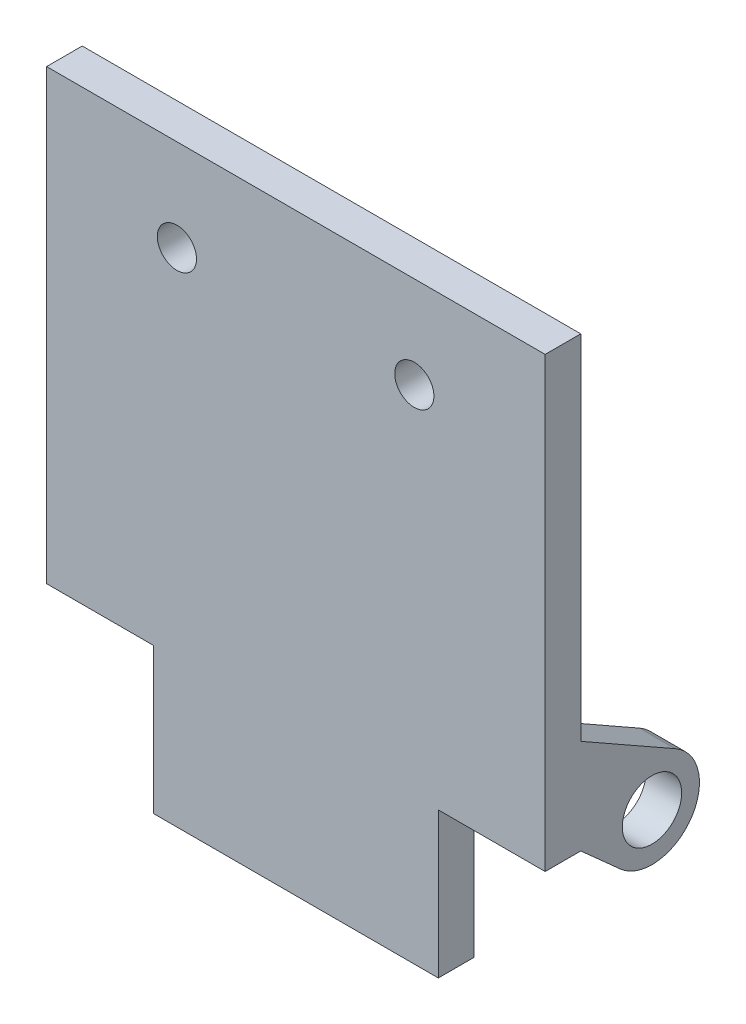
ISO-10303-21;
HEADER;
FILE_DESCRIPTION(('STEP AP214'),'2;1');
FILE_NAME('part.step','',(''),(''),'','','');
FILE_SCHEMA(('AUTOMOTIVE_DESIGN { 1 0 10303 214 1 1 1 1 }'));
ENDSEC;
DATA;
#1=APPLICATION_CONTEXT('core data for automotive mechanical design processes');
#2=APPLICATION_PROTOCOL_DEFINITION('international standard','automotive_design',2000,#1);
#3=PRODUCT_CONTEXT('',#1,'mechanical');
#4=PRODUCT('Part','Part','',(#3));
#5=PRODUCT_RELATED_PRODUCT_CATEGORY('part','',(#4));
#6=PRODUCT_DEFINITION_FORMATION('','',#4);
#7=PRODUCT_DEFINITION_CONTEXT('part definition',#1,'design');
#8=PRODUCT_DEFINITION('design','',#6,#7);
#9=PRODUCT_DEFINITION_SHAPE('','',#8);
#10=(LENGTH_UNIT() NAMED_UNIT(*) SI_UNIT(.MILLI.,.METRE.));
#11=(NAMED_UNIT(*) PLANE_ANGLE_UNIT() SI_UNIT($,.RADIAN.));
#12=(NAMED_UNIT(*) SI_UNIT($,.STERADIAN.) SOLID_ANGLE_UNIT());
#13=UNCERTAINTY_MEASURE_WITH_UNIT(LENGTH_MEASURE(1.E-05),#10,'distance_accuracy_value','');
#14=(GEOMETRIC_REPRESENTATION_CONTEXT(3) GLOBAL_UNCERTAINTY_ASSIGNED_CONTEXT((#13)) GLOBAL_UNIT_ASSIGNED_CONTEXT((#10,
#11,#12)) REPRESENTATION_CONTEXT('',''));
#15=CARTESIAN_POINT('',(0.,0.,0.));
#16=DIRECTION('',(0.,0.,1.));
#17=DIRECTION('',(1.,0.,0.));
#18=AXIS2_PLACEMENT_3D('',#15,#16,#17);
#19=CARTESIAN_POINT('',(0.,-22.,-9.));
#20=DIRECTION('',(1.,0.,0.));
#21=DIRECTION('',(0.,0.,-1.));
#22=AXIS2_PLACEMENT_3D('',#19,#20,#21);
#23=CYLINDRICAL_SURFACE('',#22,3.);
#24=DIRECTION('',(-1.,0.,0.));
#25=VECTOR('',#24,1.);
#26=CARTESIAN_POINT('',(0.,-22.,-12.));
#27=LINE('',#26,#25);
#28=CARTESIAN_POINT('',(-2.,-22.,-12.));
#29=VERTEX_POINT('',#28);
#30=CARTESIAN_POINT('',(-5.,-22.,-12.));
#31=VERTEX_POINT('',#30);
#32=EDGE_CURVE('E275',#29,#31,#27,.T.);
#33=ORIENTED_EDGE('',*,*,#32,.F.);
#34=CARTESIAN_POINT('',(-2.,-22.,-9.));
#35=DIRECTION('',(-1.,0.,0.));
#36=DIRECTION('',(0.,0.,1.));
#37=AXIS2_PLACEMENT_3D('',#34,#35,#36);
#38=CIRCLE('',#37,3.);
#39=CARTESIAN_POINT('',(-2.,-25.,-9.));
#40=VERTEX_POINT('',#39);
#41=EDGE_CURVE('E42',#40,#29,#38,.F.);
#42=ORIENTED_EDGE('',*,*,#41,.F.);
#43=DIRECTION('',(-1.,0.,0.));
#44=VECTOR('',#43,1.);
#45=CARTESIAN_POINT('',(0.,-25.,-9.));
#46=LINE('',#45,#44);
#47=CARTESIAN_POINT('',(-5.,-25.,-9.));
#48=VERTEX_POINT('',#47);
#49=EDGE_CURVE('E278',#48,#40,#46,.F.);
#50=ORIENTED_EDGE('',*,*,#49,.F.);
#51=CARTESIAN_POINT('',(-5.,-22.,-9.));
#52=DIRECTION('',(1.,0.,0.));
#53=DIRECTION('',(0.,0.,-1.));
#54=AXIS2_PLACEMENT_3D('',#51,#52,#53);
#55=CIRCLE('',#54,3.);
#56=EDGE_CURVE('E11',#31,#48,#55,.F.);
#57=ORIENTED_EDGE('',*,*,#56,.F.);
#58=EDGE_LOOP('',(#33,#42,#50,#57));
#59=FACE_BOUND('',#58,.T.);
#60=ADVANCED_FACE('F35',(#59),#23,.T.);
#61=CARTESIAN_POINT('',(3.,-25.,-5.));
#62=DIRECTION('',(0.,1.,0.));
#63=DIRECTION('',(0.,0.,1.));
#64=AXIS2_PLACEMENT_3D('',#61,#62,#63);
#65=CYLINDRICAL_SURFACE('',#64,5.);
#66=DIRECTION('',(0.,-1.,0.));
#67=VECTOR('',#66,1.);
#68=CARTESIAN_POINT('',(-2.,-25.,-5.));
#69=LINE('',#68,#67);
#70=CARTESIAN_POINT('',(-2.00000000000001,-22.3213273555428,-5.));
#71=VERTEX_POINT('',#70);
#72=CARTESIAN_POINT('',(-2.,-25.,-5.));
#73=VERTEX_POINT('',#72);
#74=EDGE_CURVE('E256',#71,#73,#69,.T.);
#75=ORIENTED_EDGE('',*,*,#74,.F.);
#76=CARTESIAN_POINT('',(-2.,-22.3213273555428,-5.));
#77=CARTESIAN_POINT('',(-1.99999865585259,-22.2943329322178,-4.99084010306282));
#78=CARTESIAN_POINT('',(-1.99997491273948,-22.2669598406963,-4.98283974000465));
#79=CARTESIAN_POINT('',(-1.99991009282106,-22.2116319119546,-4.96920322745092));
#80=CARTESIAN_POINT('',(-1.99986901655374,-22.1836770928155,-4.96356700458812));
#81=CARTESIAN_POINT('',(-1.99976297078285,-22.100758774533,-4.95051671034814));
#82=CARTESIAN_POINT('',(-1.99971208677647,-22.0452280026263,-4.94645296537758));
#83=CARTESIAN_POINT('',(-1.99972610145055,-21.9376170385381,-4.94755422390843));
#84=CARTESIAN_POINT('',(-1.9997842605876,-21.8855290151298,-4.95218206351612));
#85=CARTESIAN_POINT('',(-1.99991037932591,-21.7813705812722,-4.9696876815776));
#86=CARTESIAN_POINT('',(-1.99997855354375,-21.7293354875285,-4.98277579106642));
#87=CARTESIAN_POINT('',(-2.,-21.6786726444572,-5.));
#88=B_SPLINE_CURVE_WITH_KNOTS('',3,(#76,#77,#78,#79,#80,#81,#82,#83,#84,#85,#86,#87),
.UNSPECIFIED.,.F.,.F.,(4,2,2,2,2,4),(0.,0.0854646806368067,0.170926708820562,0.337122472356156,
0.493383210814905,0.653686460042212),.UNSPECIFIED.);
#89=CARTESIAN_POINT('',(-2.00000000000001,-21.6786726444572,-5.));
#90=VERTEX_POINT('',#89);
#91=EDGE_CURVE('E424',#71,#90,#88,.T.);
#92=ORIENTED_EDGE('',*,*,#91,.T.);
#93=CARTESIAN_POINT('',(-2.,-20.,-5.));
#94=VERTEX_POINT('',#93);
#95=EDGE_CURVE('E257',#94,#90,#69,.T.);
#96=ORIENTED_EDGE('',*,*,#95,.F.);
#97=CARTESIAN_POINT('',(3.,-20.,-5.));
#98=DIRECTION('',(0.,-1.,0.));
#99=DIRECTION('',(0.,0.,-1.));
#100=AXIS2_PLACEMENT_3D('',#97,#98,#99);
#101=CIRCLE('',#100,5.);
#102=CARTESIAN_POINT('',(3.,-20.,0.));
#103=VERTEX_POINT('',#102);
#104=EDGE_CURVE('E263',#94,#103,#101,.F.);
#105=ORIENTED_EDGE('',*,*,#104,.T.);
#106=DIRECTION('',(0.,-1.,0.));
#107=VECTOR('',#106,1.);
#108=CARTESIAN_POINT('',(3.,-25.,0.));
#109=LINE('',#108,#107);
#110=CARTESIAN_POINT('',(2.99999999999999,-25.,0.));
#111=VERTEX_POINT('',#110);
#112=EDGE_CURVE('E260',#111,#103,#109,.F.);
#113=ORIENTED_EDGE('',*,*,#112,.F.);
#114=CARTESIAN_POINT('',(3.,-25.,-5.));
#115=DIRECTION('',(0.,1.,0.));
#116=DIRECTION('',(0.,0.,1.));
#117=AXIS2_PLACEMENT_3D('',#114,#115,#116);
#118=CIRCLE('',#117,5.);
#119=EDGE_CURVE('E266',#111,#73,#118,.F.);
#120=ORIENTED_EDGE('',*,*,#119,.T.);
#121=EDGE_LOOP('',(#75,#92,#96,#105,#113,#120));
#122=FACE_BOUND('',#121,.T.);
#123=ADVANCED_FACE('F433',(#122),#65,.F.);
#124=CARTESIAN_POINT('',(3.,3.,-5.));
#125=DIRECTION('',(0.,1.,0.));
#126=DIRECTION('',(0.,0.,1.));
#127=AXIS2_PLACEMENT_3D('',#124,#125,#126);
#128=CYLINDRICAL_SURFACE('',#127,5.);
#129=DIRECTION('',(0.,-1.,0.));
#130=VECTOR('',#129,1.);
#131=CARTESIAN_POINT('',(-2.,3.,-5.));
#132=LINE('',#131,#130);
#133=CARTESIAN_POINT('',(-2.00000000000001,4.67867264445724,-5.));
#134=VERTEX_POINT('',#133);
#135=CARTESIAN_POINT('',(-2.,3.,-5.));
#136=VERTEX_POINT('',#135);
#137=EDGE_CURVE('E243',#134,#136,#132,.T.);
#138=ORIENTED_EDGE('',*,*,#137,.F.);
#139=CARTESIAN_POINT('',(-2.,4.67867264445724,-5.));
#140=CARTESIAN_POINT('',(-1.99999865585259,4.70566706778223,-4.99084010306282));
#141=CARTESIAN_POINT('',(-1.99997491273948,4.7330401593037,-4.98283974000465));
#142=CARTESIAN_POINT('',(-1.99991009282106,4.78836808804543,-4.96920322745092));
#143=CARTESIAN_POINT('',(-1.99986901655374,4.81632290718446,-4.96356700458812));
#144=CARTESIAN_POINT('',(-1.99976297078285,4.89924122546695,-4.95051671034814));
#145=CARTESIAN_POINT('',(-1.99971208677647,4.95477199737372,-4.94645296537758));
#146=CARTESIAN_POINT('',(-1.99972610145055,5.06238296146194,-4.94755422390843));
#147=CARTESIAN_POINT('',(-1.9997842605876,5.11447098487021,-4.95218206351612));
#148=CARTESIAN_POINT('',(-1.99991037932591,5.21862941872778,-4.9696876815776));
#149=CARTESIAN_POINT('',(-1.99997855354375,5.27066451247151,-4.98277579106642));
#150=CARTESIAN_POINT('',(-2.,5.32132735554276,-5.));
#151=B_SPLINE_CURVE_WITH_KNOTS('',3,(#139,#140,#141,#142,#143,#144,#145,#146,#147,#148,#149,
#150),.UNSPECIFIED.,.F.,.F.,(4,2,2,2,2,4),(0.,0.0854646806368086,0.170926708820562,
0.337122472356154,0.493383210814903,0.653686460042209),.UNSPECIFIED.);
#152=CARTESIAN_POINT('',(-2.00000000000001,5.32132735554276,-5.));
#153=VERTEX_POINT('',#152);
#154=EDGE_CURVE('E396',#134,#153,#151,.T.);
#155=ORIENTED_EDGE('',*,*,#154,.T.);
#156=CARTESIAN_POINT('',(-2.,13.,-5.));
#157=VERTEX_POINT('',#156);
#158=EDGE_CURVE('E244',#157,#153,#132,.T.);
#159=ORIENTED_EDGE('',*,*,#158,.F.);
#160=CARTESIAN_POINT('',(3.,13.,-5.));
#161=DIRECTION('',(0.,-1.,0.));
#162=DIRECTION('',(0.,0.,-1.));
#163=AXIS2_PLACEMENT_3D('',#160,#161,#162);
#164=CIRCLE('',#163,5.);
#165=CARTESIAN_POINT('',(3.,13.,0.));
#166=VERTEX_POINT('',#165);
#167=EDGE_CURVE('E250',#157,#166,#164,.F.);
#168=ORIENTED_EDGE('',*,*,#167,.T.);
#169=DIRECTION('',(0.,-1.,0.));
#170=VECTOR('',#169,1.);
#171=CARTESIAN_POINT('',(3.,3.,0.));
#172=LINE('',#171,#170);
#173=CARTESIAN_POINT('',(3.,3.,0.));
#174=VERTEX_POINT('',#173);
#175=EDGE_CURVE('E247',#174,#166,#172,.F.);
#176=ORIENTED_EDGE('',*,*,#175,.F.);
#177=CARTESIAN_POINT('',(3.,3.,-5.));
#178=DIRECTION('',(0.,1.,0.));
#179=DIRECTION('',(-1.,0.,0.));
#180=AXIS2_PLACEMENT_3D('',#177,#178,#179);
#181=CIRCLE('',#180,5.);
#182=EDGE_CURVE('E253',#174,#136,#181,.F.);
#183=ORIENTED_EDGE('',*,*,#182,.T.);
#184=EDGE_LOOP('',(#138,#155,#159,#168,#176,#183));
#185=FACE_BOUND('',#184,.T.);
#186=ADVANCED_FACE('F406',(#185),#128,.F.);
#187=CARTESIAN_POINT('',(0.,0.,0.));
#188=DIRECTION('',(0.,0.,1.));
#189=DIRECTION('',(1.,0.,0.));
#190=AXIS2_PLACEMENT_3D('',#187,#188,#189);
#191=PLANE('',#190);
#192=CARTESIAN_POINT('',(-10.0242005084872,17.2660463593125,0.));
#193=DIRECTION('',(0.,0.,1.));
#194=DIRECTION('',(1.,0.,0.));
#195=AXIS2_PLACEMENT_3D('',#192,#193,#194);
#196=CIRCLE('',#195,1.65);
#197=CARTESIAN_POINT('',(-8.37420050848724,17.2660463593125,0.));
#198=VERTEX_POINT('',#197);
#199=EDGE_CURVE('E734',#198,#198,#196,.T.);
#200=ORIENTED_EDGE('',*,*,#199,.T.);
#201=EDGE_LOOP('',(#200));
#202=FACE_BOUND('',#201,.T.);
#203=CARTESIAN_POINT('',(9.97579949151276,17.2660463593125,0.));
#204=DIRECTION('',(0.,0.,1.));
#205=DIRECTION('',(1.,0.,0.));
#206=AXIS2_PLACEMENT_3D('',#203,#204,#205);
#207=CIRCLE('',#206,1.65);
#208=CARTESIAN_POINT('',(11.6257994915128,17.2660463593125,0.));
#209=VERTEX_POINT('',#208);
#210=EDGE_CURVE('E335',#209,#209,#207,.T.);
#211=ORIENTED_EDGE('',*,*,#210,.T.);
#212=EDGE_LOOP('',(#211));
#213=FACE_BOUND('',#212,.T.);
#214=DIRECTION('',(1.,0.,0.));
#215=VECTOR('',#214,1.);
#216=CARTESIAN_POINT('',(-21.,-25.,0.));
#217=LINE('',#216,#215);
#218=CARTESIAN_POINT('',(-12.,-25.,0.));
#219=VERTEX_POINT('',#218);
#220=CARTESIAN_POINT('',(-5.00000000000001,-25.,0.));
#221=VERTEX_POINT('',#220);
#222=EDGE_CURVE('E236',#219,#221,#217,.T.);
#223=ORIENTED_EDGE('',*,*,#222,.F.);
#224=DIRECTION('',(0.,-1.,0.));
#225=VECTOR('',#224,1.);
#226=CARTESIAN_POINT('',(-12.,-25.,0.));
#227=LINE('',#226,#225);
#228=CARTESIAN_POINT('',(-12.,-12.7339536406875,0.));
#229=VERTEX_POINT('',#228);
#230=EDGE_CURVE('E206',#229,#219,#227,.T.);
#231=ORIENTED_EDGE('',*,*,#230,.F.);
#232=DIRECTION('',(1.,0.,0.));
#233=VECTOR('',#232,1.);
#234=CARTESIAN_POINT('',(-21.,-12.7339536406875,0.));
#235=LINE('',#234,#233);
#236=CARTESIAN_POINT('',(-21.,-12.7339536406875,0.));
#237=VERTEX_POINT('',#236);
#238=EDGE_CURVE('E334',#237,#229,#235,.T.);
#239=ORIENTED_EDGE('',*,*,#238,.F.);
#240=DIRECTION('',(0.,-1.,0.));
#241=VECTOR('',#240,1.);
#242=CARTESIAN_POINT('',(-21.,25.,0.));
#243=LINE('',#242,#241);
#244=CARTESIAN_POINT('',(-21.,25.,0.));
#245=VERTEX_POINT('',#244);
#246=EDGE_CURVE('E215',#245,#237,#243,.T.);
#247=ORIENTED_EDGE('',*,*,#246,.F.);
#248=DIRECTION('',(-1.,0.,0.));
#249=VECTOR('',#248,1.);
#250=CARTESIAN_POINT('',(-21.,25.,0.));
#251=LINE('',#250,#249);
#252=CARTESIAN_POINT('',(21.,25.,0.));
#253=VERTEX_POINT('',#252);
#254=EDGE_CURVE('E231',#253,#245,#251,.T.);
#255=ORIENTED_EDGE('',*,*,#254,.F.);
#256=DIRECTION('',(0.,1.,0.));
#257=VECTOR('',#256,1.);
#258=CARTESIAN_POINT('',(21.,25.,0.));
#259=LINE('',#258,#257);
#260=CARTESIAN_POINT('',(21.,-4.73395364068748,0.));
#261=VERTEX_POINT('',#260);
#262=EDGE_CURVE('E229',#261,#253,#259,.T.);
#263=ORIENTED_EDGE('',*,*,#262,.F.);
#264=DIRECTION('',(1.,0.,0.));
#265=VECTOR('',#264,1.);
#266=CARTESIAN_POINT('',(18.,-4.73395364068748,0.));
#267=LINE('',#266,#265);
#268=CARTESIAN_POINT('',(18.,-4.73395364068748,0.));
#269=VERTEX_POINT('',#268);
#270=EDGE_CURVE('E380',#269,#261,#267,.T.);
#271=ORIENTED_EDGE('',*,*,#270,.F.);
#272=DIRECTION('',(0.,-1.,0.));
#273=VECTOR('',#272,1.);
#274=CARTESIAN_POINT('',(18.,-4.73395364068748,0.));
#275=LINE('',#274,#273);
#276=CARTESIAN_POINT('',(18.,-12.7339536406875,0.));
#277=VERTEX_POINT('',#276);
#278=EDGE_CURVE('E370',#269,#277,#275,.T.);
#279=ORIENTED_EDGE('',*,*,#278,.T.);
#280=DIRECTION('',(1.,0.,0.));
#281=VECTOR('',#280,1.);
#282=CARTESIAN_POINT('',(21.,-12.7339536406875,0.));
#283=LINE('',#282,#281);
#284=CARTESIAN_POINT('',(12.,-12.7339536406875,0.));
#285=VERTEX_POINT('',#284);
#286=EDGE_CURVE('E350',#285,#277,#283,.T.);
#287=ORIENTED_EDGE('',*,*,#286,.F.);
#288=DIRECTION('',(0.,1.,0.));
#289=VECTOR('',#288,1.);
#290=CARTESIAN_POINT('',(12.,-25.,0.));
#291=LINE('',#290,#289);
#292=CARTESIAN_POINT('',(12.,-25.,0.));
#293=VERTEX_POINT('',#292);
#294=EDGE_CURVE('E346',#293,#285,#291,.T.);
#295=ORIENTED_EDGE('',*,*,#294,.F.);
#296=EDGE_CURVE('E235',#111,#293,#217,.T.);
#297=ORIENTED_EDGE('',*,*,#296,.F.);
#298=ORIENTED_EDGE('',*,*,#112,.T.);
#299=DIRECTION('',(1.,0.,0.));
#300=VECTOR('',#299,1.);
#301=CARTESIAN_POINT('',(-5.,-20.,0.));
#302=LINE('',#301,#300);
#303=CARTESIAN_POINT('',(-5.,-20.,0.));
#304=VERTEX_POINT('',#303);
#305=EDGE_CURVE('E303',#304,#103,#302,.T.);
#306=ORIENTED_EDGE('',*,*,#305,.F.);
#307=DIRECTION('',(0.,1.,0.));
#308=VECTOR('',#307,1.);
#309=CARTESIAN_POINT('',(-5.,-25.,0.));
#310=LINE('',#309,#308);
#311=EDGE_CURVE('E300',#221,#304,#310,.T.);
#312=ORIENTED_EDGE('',*,*,#311,.F.);
#313=EDGE_LOOP('',(#223,#231,#239,#247,#255,#263,#271,#279,#287,#295,#297,#298,#306,#312));
#314=FACE_BOUND('',#313,.T.);
#315=ORIENTED_EDGE('',*,*,#175,.T.);
#316=DIRECTION('',(1.,0.,0.));
#317=VECTOR('',#316,1.);
#318=CARTESIAN_POINT('',(-5.,13.,0.));
#319=LINE('',#318,#317);
#320=CARTESIAN_POINT('',(-5.,13.,0.));
#321=VERTEX_POINT('',#320);
#322=EDGE_CURVE('E780',#321,#166,#319,.T.);
#323=ORIENTED_EDGE('',*,*,#322,.F.);
#324=DIRECTION('',(0.,1.,0.));
#325=VECTOR('',#324,1.);
#326=CARTESIAN_POINT('',(-5.,3.,0.));
#327=LINE('',#326,#325);
#328=CARTESIAN_POINT('',(-5.,3.,0.));
#329=VERTEX_POINT('',#328);
#330=EDGE_CURVE('E430',#329,#321,#327,.T.);
#331=ORIENTED_EDGE('',*,*,#330,.F.);
#332=DIRECTION('',(-1.,0.,0.));
#333=VECTOR('',#332,1.);
#334=CARTESIAN_POINT('',(-5.,3.,0.));
#335=LINE('',#334,#333);
#336=EDGE_CURVE('E765',#174,#329,#335,.T.);
#337=ORIENTED_EDGE('',*,*,#336,.F.);
#338=EDGE_LOOP('',(#315,#323,#331,#337));
#339=FACE_BOUND('',#338,.T.);
#340=ADVANCED_FACE('F331',(#202,#213,#314,#339),#191,.F.);
#341=CARTESIAN_POINT('',(21.,25.,3.));
#342=DIRECTION('',(-1.,0.,0.));
#343=DIRECTION('',(0.,-1.,0.));
#344=AXIS2_PLACEMENT_3D('',#341,#342,#343);
#345=PLANE('',#344);
#346=DIRECTION('',(0.,1.,0.));
#347=VECTOR('',#346,1.);
#348=CARTESIAN_POINT('',(21.,25.,3.));
#349=LINE('',#348,#347);
#350=CARTESIAN_POINT('',(21.,-12.7339536406875,3.));
#351=VERTEX_POINT('',#350);
#352=CARTESIAN_POINT('',(21.,25.,3.));
#353=VERTEX_POINT('',#352);
#354=EDGE_CURVE('E225',#351,#353,#349,.T.);
#355=ORIENTED_EDGE('',*,*,#354,.F.);
#356=DIRECTION('',(0.,0.,-1.));
#357=VECTOR('',#356,1.);
#358=CARTESIAN_POINT('',(21.,-12.7339536406875,3.));
#359=LINE('',#358,#357);
#360=CARTESIAN_POINT('',(21.,-12.7339536406875,0.));
#361=VERTEX_POINT('',#360);
#362=EDGE_CURVE('E356',#351,#361,#359,.T.);
#363=ORIENTED_EDGE('',*,*,#362,.T.);
#364=DIRECTION('',(0.,-0.666666666666667,-0.74535599249993));
#365=VECTOR('',#364,1.);
#366=CARTESIAN_POINT('',(21.,-12.7339536406875,0.));
#367=LINE('',#366,#365);
#368=CARTESIAN_POINT('',(21.,-15.7153776106872,-3.33333333333333));
#369=VERTEX_POINT('',#368);
#370=EDGE_CURVE('E382',#361,#369,#367,.T.);
#371=ORIENTED_EDGE('',*,*,#370,.T.);
#372=CARTESIAN_POINT('',(21.,-12.7339536406875,-6.));
#373=DIRECTION('',(1.,0.,0.));
#374=DIRECTION('',(0.,1.,0.));
#375=AXIS2_PLACEMENT_3D('',#372,#373,#374);
#376=CIRCLE('',#375,4.);
#377=CARTESIAN_POINT('',(21.,-9.25431730710868,-7.97284844477174));
#378=VERTEX_POINT('',#377);
#379=EDGE_CURVE('E371',#369,#378,#376,.T.);
#380=ORIENTED_EDGE('',*,*,#379,.T.);
#381=DIRECTION('',(0.,0.493212111192935,0.869909083394701));
#382=VECTOR('',#381,1.);
#383=CARTESIAN_POINT('',(21.,-4.73395364068748,0.));
#384=LINE('',#383,#382);
#385=EDGE_CURVE('E326',#378,#261,#384,.T.);
#386=ORIENTED_EDGE('',*,*,#385,.T.);
#387=ORIENTED_EDGE('',*,*,#262,.T.);
#388=DIRECTION('',(0.,0.,-1.));
#389=VECTOR('',#388,1.);
#390=CARTESIAN_POINT('',(21.,25.,3.));
#391=LINE('',#390,#389);
#392=EDGE_CURVE('E240',#353,#253,#391,.T.);
#393=ORIENTED_EDGE('',*,*,#392,.F.);
#394=EDGE_LOOP('',(#355,#363,#371,#380,#386,#387,#393));
#395=FACE_BOUND('',#394,.T.);
#396=CARTESIAN_POINT('',(21.,-12.7339536406875,-6.));
#397=DIRECTION('',(1.,0.,0.));
#398=DIRECTION('',(0.,1.,0.));
#399=AXIS2_PLACEMENT_3D('',#396,#397,#398);
#400=CIRCLE('',#399,2.5);
#401=CARTESIAN_POINT('',(21.,-10.2339536406875,-6.));
#402=VERTEX_POINT('',#401);
#403=EDGE_CURVE('E358',#402,#402,#400,.T.);
#404=ORIENTED_EDGE('',*,*,#403,.F.);
#405=EDGE_LOOP('',(#404));
#406=FACE_BOUND('',#405,.T.);
#407=ADVANCED_FACE('F320',(#395,#406),#345,.F.);
#408=CARTESIAN_POINT('',(-21.,25.,3.));
#409=DIRECTION('',(0.,-1.,0.));
#410=DIRECTION('',(0.,0.,-1.));
#411=AXIS2_PLACEMENT_3D('',#408,#409,#410);
#412=PLANE('',#411);
#413=ORIENTED_EDGE('',*,*,#254,.T.);
#414=DIRECTION('',(0.,0.,-1.));
#415=VECTOR('',#414,1.);
#416=CARTESIAN_POINT('',(-21.,25.,3.));
#417=LINE('',#416,#415);
#418=CARTESIAN_POINT('',(-21.,25.,3.));
#419=VERTEX_POINT('',#418);
#420=EDGE_CURVE('E223',#419,#245,#417,.T.);
#421=ORIENTED_EDGE('',*,*,#420,.F.);
#422=DIRECTION('',(-1.,0.,0.));
#423=VECTOR('',#422,1.);
#424=CARTESIAN_POINT('',(-21.,25.,3.));
#425=LINE('',#424,#423);
#426=EDGE_CURVE('E219',#353,#419,#425,.T.);
#427=ORIENTED_EDGE('',*,*,#426,.F.);
#428=ORIENTED_EDGE('',*,*,#392,.T.);
#429=EDGE_LOOP('',(#413,#421,#427,#428));
#430=FACE_BOUND('',#429,.T.);
#431=ADVANCED_FACE('F319',(#430),#412,.F.);
#432=CARTESIAN_POINT('',(-21.,25.,3.));
#433=DIRECTION('',(1.,0.,0.));
#434=DIRECTION('',(0.,1.,0.));
#435=AXIS2_PLACEMENT_3D('',#432,#433,#434);
#436=PLANE('',#435);
#437=ORIENTED_EDGE('',*,*,#246,.T.);
#438=DIRECTION('',(0.,0.,-1.));
#439=VECTOR('',#438,1.);
#440=CARTESIAN_POINT('',(-21.,-12.7339536406875,3.));
#441=LINE('',#440,#439);
#442=CARTESIAN_POINT('',(-21.,-12.7339536406875,3.));
#443=VERTEX_POINT('',#442);
#444=EDGE_CURVE('E199',#443,#237,#441,.T.);
#445=ORIENTED_EDGE('',*,*,#444,.F.);
#446=DIRECTION('',(0.,-1.,0.));
#447=VECTOR('',#446,1.);
#448=CARTESIAN_POINT('',(-21.,25.,3.));
#449=LINE('',#448,#447);
#450=EDGE_CURVE('E213',#419,#443,#449,.T.);
#451=ORIENTED_EDGE('',*,*,#450,.F.);
#452=ORIENTED_EDGE('',*,*,#420,.T.);
#453=EDGE_LOOP('',(#437,#445,#451,#452));
#454=FACE_BOUND('',#453,.T.);
#455=ADVANCED_FACE('F211',(#454),#436,.F.);
#456=CARTESIAN_POINT('',(-21.,-25.,3.));
#457=DIRECTION('',(0.,1.,0.));
#458=DIRECTION('',(0.,0.,1.));
#459=AXIS2_PLACEMENT_3D('',#456,#457,#458);
#460=PLANE('',#459);
#461=DIRECTION('',(0.,0.,1.));
#462=VECTOR('',#461,1.);
#463=CARTESIAN_POINT('',(-5.,-25.,-12.));
#464=LINE('',#463,#462);
#465=EDGE_CURVE('E293',#48,#221,#464,.T.);
#466=ORIENTED_EDGE('',*,*,#465,.F.);
#467=ORIENTED_EDGE('',*,*,#49,.T.);
#468=DIRECTION('',(0.,0.,1.));
#469=VECTOR('',#468,1.);
#470=CARTESIAN_POINT('',(-2.,-25.,-12.));
#471=LINE('',#470,#469);
#472=EDGE_CURVE('E287',#40,#73,#471,.T.);
#473=ORIENTED_EDGE('',*,*,#472,.T.);
#474=ORIENTED_EDGE('',*,*,#119,.F.);
#475=ORIENTED_EDGE('',*,*,#296,.T.);
#476=DIRECTION('',(0.,0.,-1.));
#477=VECTOR('',#476,1.);
#478=CARTESIAN_POINT('',(12.,-25.,3.));
#479=LINE('',#478,#477);
#480=CARTESIAN_POINT('',(12.,-25.,3.));
#481=VERTEX_POINT('',#480);
#482=EDGE_CURVE('E352',#481,#293,#479,.T.);
#483=ORIENTED_EDGE('',*,*,#482,.F.);
#484=DIRECTION('',(1.,0.,0.));
#485=VECTOR('',#484,1.);
#486=CARTESIAN_POINT('',(-21.,-25.,3.));
#487=LINE('',#486,#485);
#488=CARTESIAN_POINT('',(-12.,-25.,3.));
#489=VERTEX_POINT('',#488);
#490=EDGE_CURVE('E221',#489,#481,#487,.T.);
#491=ORIENTED_EDGE('',*,*,#490,.F.);
#492=DIRECTION('',(0.,0.,-1.));
#493=VECTOR('',#492,1.);
#494=CARTESIAN_POINT('',(-12.,-25.,3.));
#495=LINE('',#494,#493);
#496=EDGE_CURVE('E343',#489,#219,#495,.T.);
#497=ORIENTED_EDGE('',*,*,#496,.T.);
#498=ORIENTED_EDGE('',*,*,#222,.T.);
#499=EDGE_LOOP('',(#466,#467,#473,#474,#475,#483,#491,#497,#498));
#500=FACE_BOUND('',#499,.T.);
#501=ADVANCED_FACE('F455',(#500),#460,.F.);
#502=CARTESIAN_POINT('',(0.,0.,3.));
#503=DIRECTION('',(0.,0.,1.));
#504=DIRECTION('',(1.,0.,0.));
#505=AXIS2_PLACEMENT_3D('',#502,#503,#504);
#506=PLANE('',#505);
#507=CARTESIAN_POINT('',(-10.0242005084872,17.2660463593125,3.));
#508=DIRECTION('',(0.,0.,1.));
#509=DIRECTION('',(1.,0.,0.));
#510=AXIS2_PLACEMENT_3D('',#507,#508,#509);
#511=CIRCLE('',#510,1.65);
#512=CARTESIAN_POINT('',(-8.37420050848724,17.2660463593125,3.));
#513=VERTEX_POINT('',#512);
#514=EDGE_CURVE('E731',#513,#513,#511,.T.);
#515=ORIENTED_EDGE('',*,*,#514,.F.);
#516=EDGE_LOOP('',(#515));
#517=FACE_BOUND('',#516,.T.);
#518=CARTESIAN_POINT('',(9.97579949151276,17.2660463593125,3.));
#519=DIRECTION('',(0.,0.,1.));
#520=DIRECTION('',(1.,0.,0.));
#521=AXIS2_PLACEMENT_3D('',#518,#519,#520);
#522=CIRCLE('',#521,1.65);
#523=CARTESIAN_POINT('',(11.6257994915128,17.2660463593125,3.));
#524=VERTEX_POINT('',#523);
#525=EDGE_CURVE('E339',#524,#524,#522,.T.);
#526=ORIENTED_EDGE('',*,*,#525,.F.);
#527=EDGE_LOOP('',(#526));
#528=FACE_BOUND('',#527,.T.);
#529=DIRECTION('',(0.,-1.,0.));
#530=VECTOR('',#529,1.);
#531=CARTESIAN_POINT('',(-12.,-25.,3.));
#532=LINE('',#531,#530);
#533=CARTESIAN_POINT('',(-12.,-12.7339536406875,3.));
#534=VERTEX_POINT('',#533);
#535=EDGE_CURVE('E205',#534,#489,#532,.T.);
#536=ORIENTED_EDGE('',*,*,#535,.T.);
#537=ORIENTED_EDGE('',*,*,#490,.T.);
#538=DIRECTION('',(0.,1.,0.));
#539=VECTOR('',#538,1.);
#540=CARTESIAN_POINT('',(12.,-25.,3.));
#541=LINE('',#540,#539);
#542=CARTESIAN_POINT('',(12.,-12.7339536406875,3.));
#543=VERTEX_POINT('',#542);
#544=EDGE_CURVE('E348',#481,#543,#541,.T.);
#545=ORIENTED_EDGE('',*,*,#544,.T.);
#546=DIRECTION('',(1.,0.,0.));
#547=VECTOR('',#546,1.);
#548=CARTESIAN_POINT('',(21.,-12.7339536406875,3.));
#549=LINE('',#548,#547);
#550=EDGE_CURVE('E314',#543,#351,#549,.T.);
#551=ORIENTED_EDGE('',*,*,#550,.T.);
#552=ORIENTED_EDGE('',*,*,#354,.T.);
#553=ORIENTED_EDGE('',*,*,#426,.T.);
#554=ORIENTED_EDGE('',*,*,#450,.T.);
#555=DIRECTION('',(1.,0.,0.));
#556=VECTOR('',#555,1.);
#557=CARTESIAN_POINT('',(-21.,-12.7339536406875,3.));
#558=LINE('',#557,#556);
#559=EDGE_CURVE('E195',#443,#534,#558,.T.);
#560=ORIENTED_EDGE('',*,*,#559,.T.);
#561=EDGE_LOOP('',(#536,#537,#545,#551,#552,#553,#554,#560));
#562=FACE_BOUND('',#561,.T.);
#563=ADVANCED_FACE('F217',(#517,#528,#562),#506,.T.);
#564=CARTESIAN_POINT('',(-5.,-25.,-12.));
#565=DIRECTION('',(1.,0.,0.));
#566=DIRECTION('',(0.,0.,-1.));
#567=AXIS2_PLACEMENT_3D('',#564,#565,#566);
#568=PLANE('',#567);
#569=CARTESIAN_POINT('',(-5.,-22.,-5.94696817822982));
#570=DIRECTION('',(-1.,0.,0.));
#571=DIRECTION('',(0.,0.,1.));
#572=AXIS2_PLACEMENT_3D('',#569,#570,#571);
#573=CIRCLE('',#572,1.);
#574=CARTESIAN_POINT('',(-5.,-22.,-4.94696817822982));
#575=VERTEX_POINT('',#574);
#576=EDGE_CURVE('E404',#575,#575,#573,.T.);
#577=ORIENTED_EDGE('',*,*,#576,.F.);
#578=EDGE_LOOP('',(#577));
#579=FACE_BOUND('',#578,.T.);
#580=DIRECTION('',(0.,1.,0.));
#581=VECTOR('',#580,1.);
#582=CARTESIAN_POINT('',(-5.,-25.,-12.));
#583=LINE('',#582,#581);
#584=CARTESIAN_POINT('',(-5.,-20.,-12.));
#585=VERTEX_POINT('',#584);
#586=EDGE_CURVE('E296',#31,#585,#583,.T.);
#587=ORIENTED_EDGE('',*,*,#586,.F.);
#588=ORIENTED_EDGE('',*,*,#56,.T.);
#589=ORIENTED_EDGE('',*,*,#465,.T.);
#590=ORIENTED_EDGE('',*,*,#311,.T.);
#591=DIRECTION('',(0.,0.,1.));
#592=VECTOR('',#591,1.);
#593=CARTESIAN_POINT('',(-5.,-20.,-12.));
#594=LINE('',#593,#592);
#595=EDGE_CURVE('E232',#585,#304,#594,.T.);
#596=ORIENTED_EDGE('',*,*,#595,.F.);
#597=EDGE_LOOP('',(#587,#588,#589,#590,#596));
#598=FACE_BOUND('',#597,.T.);
#599=ADVANCED_FACE('F457',(#579,#598),#568,.F.);
#600=CARTESIAN_POINT('',(-5.,-20.,-12.));
#601=DIRECTION('',(0.,-1.,0.));
#602=DIRECTION('',(0.,0.,-1.));
#603=AXIS2_PLACEMENT_3D('',#600,#601,#602);
#604=PLANE('',#603);
#605=ORIENTED_EDGE('',*,*,#305,.T.);
#606=ORIENTED_EDGE('',*,*,#104,.F.);
#607=DIRECTION('',(0.,0.,1.));
#608=VECTOR('',#607,1.);
#609=CARTESIAN_POINT('',(-2.,-20.,-12.));
#610=LINE('',#609,#608);
#611=CARTESIAN_POINT('',(-2.,-20.,-12.));
#612=VERTEX_POINT('',#611);
#613=EDGE_CURVE('E307',#612,#94,#610,.T.);
#614=ORIENTED_EDGE('',*,*,#613,.F.);
#615=DIRECTION('',(1.,0.,0.));
#616=VECTOR('',#615,1.);
#617=CARTESIAN_POINT('',(-5.,-20.,-12.));
#618=LINE('',#617,#616);
#619=EDGE_CURVE('E291',#585,#612,#618,.T.);
#620=ORIENTED_EDGE('',*,*,#619,.F.);
#621=ORIENTED_EDGE('',*,*,#595,.T.);
#622=EDGE_LOOP('',(#605,#606,#614,#620,#621));
#623=FACE_BOUND('',#622,.T.);
#624=ADVANCED_FACE('F459',(#623),#604,.F.);
#625=CARTESIAN_POINT('',(-2.,-25.,-12.));
#626=DIRECTION('',(-1.,0.,0.));
#627=DIRECTION('',(0.,0.,1.));
#628=AXIS2_PLACEMENT_3D('',#625,#626,#627);
#629=PLANE('',#628);
#630=ORIENTED_EDGE('',*,*,#472,.F.);
#631=ORIENTED_EDGE('',*,*,#41,.T.);
#632=DIRECTION('',(0.,-1.,0.));
#633=VECTOR('',#632,1.);
#634=CARTESIAN_POINT('',(-2.,-25.,-12.));
#635=LINE('',#634,#633);
#636=EDGE_CURVE('E285',#612,#29,#635,.T.);
#637=ORIENTED_EDGE('',*,*,#636,.F.);
#638=ORIENTED_EDGE('',*,*,#613,.T.);
#639=ORIENTED_EDGE('',*,*,#95,.T.);
#640=CARTESIAN_POINT('',(-2.00000000000001,-22.,-5.94696817822982));
#641=DIRECTION('',(-1.,0.,0.));
#642=DIRECTION('',(0.,0.,1.));
#643=AXIS2_PLACEMENT_3D('',#640,#641,#642);
#644=CIRCLE('',#643,1.);
#645=EDGE_CURVE('E269',#90,#71,#644,.T.);
#646=ORIENTED_EDGE('',*,*,#645,.T.);
#647=ORIENTED_EDGE('',*,*,#74,.T.);
#648=EDGE_LOOP('',(#630,#631,#637,#638,#639,#646,#647));
#649=FACE_BOUND('',#648,.T.);
#650=ADVANCED_FACE('F282',(#649),#629,.F.);
#651=CARTESIAN_POINT('',(0.,0.,-12.));
#652=DIRECTION('',(0.,0.,-1.));
#653=DIRECTION('',(-1.,0.,0.));
#654=AXIS2_PLACEMENT_3D('',#651,#652,#653);
#655=PLANE('',#654);
#656=ORIENTED_EDGE('',*,*,#636,.T.);
#657=ORIENTED_EDGE('',*,*,#32,.T.);
#658=ORIENTED_EDGE('',*,*,#586,.T.);
#659=ORIENTED_EDGE('',*,*,#619,.T.);
#660=EDGE_LOOP('',(#656,#657,#658,#659));
#661=FACE_BOUND('',#660,.T.);
#662=ADVANCED_FACE('F289',(#661),#655,.T.);
#663=CARTESIAN_POINT('',(-5.,3.,-12.));
#664=DIRECTION('',(1.,0.,0.));
#665=DIRECTION('',(0.,0.,-1.));
#666=AXIS2_PLACEMENT_3D('',#663,#664,#665);
#667=PLANE('',#666);
#668=CARTESIAN_POINT('',(-5.,5.,-5.94696817822982));
#669=DIRECTION('',(-1.,0.,0.));
#670=DIRECTION('',(0.,0.,1.));
#671=AXIS2_PLACEMENT_3D('',#668,#669,#670);
#672=CIRCLE('',#671,1.);
#673=CARTESIAN_POINT('',(-5.,5.,-4.94696817822982));
#674=VERTEX_POINT('',#673);
#675=EDGE_CURVE('E388',#674,#674,#672,.T.);
#676=ORIENTED_EDGE('',*,*,#675,.F.);
#677=EDGE_LOOP('',(#676));
#678=FACE_BOUND('',#677,.T.);
#679=ORIENTED_EDGE('',*,*,#330,.T.);
#680=DIRECTION('',(0.,0.,1.));
#681=VECTOR('',#680,1.);
#682=CARTESIAN_POINT('',(-5.,13.,-12.));
#683=LINE('',#682,#681);
#684=CARTESIAN_POINT('',(-5.,13.,-12.));
#685=VERTEX_POINT('',#684);
#686=EDGE_CURVE('E304',#685,#321,#683,.T.);
#687=ORIENTED_EDGE('',*,*,#686,.F.);
#688=DIRECTION('',(0.,1.,0.));
#689=VECTOR('',#688,1.);
#690=CARTESIAN_POINT('',(-5.,3.,-12.));
#691=LINE('',#690,#689);
#692=CARTESIAN_POINT('',(-5.,3.,-12.));
#693=VERTEX_POINT('',#692);
#694=EDGE_CURVE('E431',#693,#685,#691,.T.);
#695=ORIENTED_EDGE('',*,*,#694,.F.);
#696=DIRECTION('',(0.,0.,1.));
#697=VECTOR('',#696,1.);
#698=CARTESIAN_POINT('',(-5.,3.,-12.));
#699=LINE('',#698,#697);
#700=EDGE_CURVE('E776',#693,#329,#699,.T.);
#701=ORIENTED_EDGE('',*,*,#700,.T.);
#702=EDGE_LOOP('',(#679,#687,#695,#701));
#703=FACE_BOUND('',#702,.T.);
#704=ADVANCED_FACE('F527',(#678,#703),#667,.F.);
#705=CARTESIAN_POINT('',(-5.,13.,-12.));
#706=DIRECTION('',(0.,-1.,0.));
#707=DIRECTION('',(0.,0.,-1.));
#708=AXIS2_PLACEMENT_3D('',#705,#706,#707);
#709=PLANE('',#708);
#710=ORIENTED_EDGE('',*,*,#322,.T.);
#711=ORIENTED_EDGE('',*,*,#167,.F.);
#712=DIRECTION('',(0.,0.,1.));
#713=VECTOR('',#712,1.);
#714=CARTESIAN_POINT('',(-2.,13.,-12.));
#715=LINE('',#714,#713);
#716=CARTESIAN_POINT('',(-2.,13.,-12.));
#717=VERTEX_POINT('',#716);
#718=EDGE_CURVE('E768',#717,#157,#715,.T.);
#719=ORIENTED_EDGE('',*,*,#718,.F.);
#720=DIRECTION('',(1.,0.,0.));
#721=VECTOR('',#720,1.);
#722=CARTESIAN_POINT('',(-5.,13.,-12.));
#723=LINE('',#722,#721);
#724=EDGE_CURVE('E758',#685,#717,#723,.T.);
#725=ORIENTED_EDGE('',*,*,#724,.F.);
#726=ORIENTED_EDGE('',*,*,#686,.T.);
#727=EDGE_LOOP('',(#710,#711,#719,#725,#726));
#728=FACE_BOUND('',#727,.T.);
#729=ADVANCED_FACE('F536',(#728),#709,.F.);
#730=CARTESIAN_POINT('',(-2.,3.,-12.));
#731=DIRECTION('',(-1.,0.,0.));
#732=DIRECTION('',(0.,0.,1.));
#733=AXIS2_PLACEMENT_3D('',#730,#731,#732);
#734=PLANE('',#733);
#735=ORIENTED_EDGE('',*,*,#158,.T.);
#736=CARTESIAN_POINT('',(-2.00000000000001,5.,-5.94696817822982));
#737=DIRECTION('',(-1.,0.,0.));
#738=DIRECTION('',(0.,0.,1.));
#739=AXIS2_PLACEMENT_3D('',#736,#737,#738);
#740=CIRCLE('',#739,1.);
#741=EDGE_CURVE('E272',#153,#134,#740,.T.);
#742=ORIENTED_EDGE('',*,*,#741,.T.);
#743=ORIENTED_EDGE('',*,*,#137,.T.);
#744=DIRECTION('',(0.,0.,1.));
#745=VECTOR('',#744,1.);
#746=CARTESIAN_POINT('',(-2.,3.,-12.));
#747=LINE('',#746,#745);
#748=CARTESIAN_POINT('',(-2.,3.,-12.));
#749=VERTEX_POINT('',#748);
#750=EDGE_CURVE('E771',#749,#136,#747,.T.);
#751=ORIENTED_EDGE('',*,*,#750,.F.);
#752=DIRECTION('',(0.,-1.,0.));
#753=VECTOR('',#752,1.);
#754=CARTESIAN_POINT('',(-2.,3.,-12.));
#755=LINE('',#754,#753);
#756=EDGE_CURVE('E784',#717,#749,#755,.T.);
#757=ORIENTED_EDGE('',*,*,#756,.F.);
#758=ORIENTED_EDGE('',*,*,#718,.T.);
#759=EDGE_LOOP('',(#735,#742,#743,#751,#757,#758));
#760=FACE_BOUND('',#759,.T.);
#761=ADVANCED_FACE('F545',(#760),#734,.F.);
#762=CARTESIAN_POINT('',(-5.,3.,-12.));
#763=DIRECTION('',(0.,1.,0.));
#764=DIRECTION('',(-1.,0.,0.));
#765=AXIS2_PLACEMENT_3D('',#762,#763,#764);
#766=PLANE('',#765);
#767=ORIENTED_EDGE('',*,*,#336,.T.);
#768=ORIENTED_EDGE('',*,*,#700,.F.);
#769=DIRECTION('',(-1.,0.,0.));
#770=VECTOR('',#769,1.);
#771=CARTESIAN_POINT('',(-5.,3.,-12.));
#772=LINE('',#771,#770);
#773=EDGE_CURVE('E761',#749,#693,#772,.T.);
#774=ORIENTED_EDGE('',*,*,#773,.F.);
#775=ORIENTED_EDGE('',*,*,#750,.T.);
#776=ORIENTED_EDGE('',*,*,#182,.F.);
#777=EDGE_LOOP('',(#767,#768,#774,#775,#776));
#778=FACE_BOUND('',#777,.T.);
#779=ADVANCED_FACE('F553',(#778),#766,.F.);
#780=CARTESIAN_POINT('',(0.,0.,-12.));
#781=DIRECTION('',(0.,0.,-1.));
#782=DIRECTION('',(-1.,0.,0.));
#783=AXIS2_PLACEMENT_3D('',#780,#781,#782);
#784=PLANE('',#783);
#785=ORIENTED_EDGE('',*,*,#694,.T.);
#786=ORIENTED_EDGE('',*,*,#724,.T.);
#787=ORIENTED_EDGE('',*,*,#756,.T.);
#788=ORIENTED_EDGE('',*,*,#773,.T.);
#789=EDGE_LOOP('',(#785,#786,#787,#788));
#790=FACE_BOUND('',#789,.T.);
#791=ADVANCED_FACE('F421',(#790),#784,.T.);
#792=CARTESIAN_POINT('',(21.,-22.,-5.94696817822982));
#793=DIRECTION('',(-1.,0.,0.));
#794=DIRECTION('',(0.,0.,1.));
#795=AXIS2_PLACEMENT_3D('',#792,#793,#794);
#796=CYLINDRICAL_SURFACE('',#795,1.);
#797=ORIENTED_EDGE('',*,*,#576,.T.);
#798=EDGE_LOOP('',(#797));
#799=FACE_BOUND('',#798,.T.);
#800=ORIENTED_EDGE('',*,*,#645,.F.);
#801=ORIENTED_EDGE('',*,*,#91,.F.);
#802=EDGE_LOOP('',(#800,#801));
#803=FACE_BOUND('',#802,.T.);
#804=ADVANCED_FACE('F415',(#799,#803),#796,.F.);
#805=CARTESIAN_POINT('',(21.,5.,-5.94696817822982));
#806=DIRECTION('',(-1.,0.,0.));
#807=DIRECTION('',(0.,0.,1.));
#808=AXIS2_PLACEMENT_3D('',#805,#806,#807);
#809=CYLINDRICAL_SURFACE('',#808,1.);
#810=ORIENTED_EDGE('',*,*,#675,.T.);
#811=EDGE_LOOP('',(#810));
#812=FACE_BOUND('',#811,.T.);
#813=ORIENTED_EDGE('',*,*,#741,.F.);
#814=ORIENTED_EDGE('',*,*,#154,.F.);
#815=EDGE_LOOP('',(#813,#814));
#816=FACE_BOUND('',#815,.T.);
#817=ADVANCED_FACE('F409',(#812,#816),#809,.F.);
#818=CARTESIAN_POINT('',(18.,-4.73395364068748,0.));
#819=DIRECTION('',(0.,0.869909083394701,-0.493212111192935));
#820=DIRECTION('',(0.,0.493212111192935,0.869909083394701));
#821=AXIS2_PLACEMENT_3D('',#818,#819,#820);
#822=PLANE('',#821);
#823=ORIENTED_EDGE('',*,*,#385,.F.);
#824=DIRECTION('',(1.,0.,0.));
#825=VECTOR('',#824,1.);
#826=CARTESIAN_POINT('',(18.,-9.25431730710868,-7.97284844477174));
#827=LINE('',#826,#825);
#828=CARTESIAN_POINT('',(18.,-9.25431730710868,-7.97284844477174));
#829=VERTEX_POINT('',#828);
#830=EDGE_CURVE('E386',#829,#378,#827,.T.);
#831=ORIENTED_EDGE('',*,*,#830,.F.);
#832=DIRECTION('',(0.,0.493212111192935,0.869909083394701));
#833=VECTOR('',#832,1.);
#834=CARTESIAN_POINT('',(18.,-4.73395364068748,0.));
#835=LINE('',#834,#833);
#836=EDGE_CURVE('E367',#829,#269,#835,.T.);
#837=ORIENTED_EDGE('',*,*,#836,.T.);
#838=ORIENTED_EDGE('',*,*,#270,.T.);
#839=EDGE_LOOP('',(#823,#831,#837,#838));
#840=FACE_BOUND('',#839,.T.);
#841=ADVANCED_FACE('F414',(#840),#822,.T.);
#842=CARTESIAN_POINT('',(18.,-12.7339536406875,-6.));
#843=DIRECTION('',(1.,0.,0.));
#844=DIRECTION('',(0.,1.,0.));
#845=AXIS2_PLACEMENT_3D('',#842,#843,#844);
#846=CYLINDRICAL_SURFACE('',#845,4.);
#847=ORIENTED_EDGE('',*,*,#379,.F.);
#848=DIRECTION('',(1.,0.,0.));
#849=VECTOR('',#848,1.);
#850=CARTESIAN_POINT('',(18.,-15.7153776106872,-3.33333333333333));
#851=LINE('',#850,#849);
#852=CARTESIAN_POINT('',(18.,-15.7153776106872,-3.33333333333333));
#853=VERTEX_POINT('',#852);
#854=EDGE_CURVE('E389',#853,#369,#851,.T.);
#855=ORIENTED_EDGE('',*,*,#854,.F.);
#856=CARTESIAN_POINT('',(18.,-12.7339536406875,-6.));
#857=DIRECTION('',(1.,0.,0.));
#858=DIRECTION('',(0.,1.,0.));
#859=AXIS2_PLACEMENT_3D('',#856,#857,#858);
#860=CIRCLE('',#859,4.);
#861=EDGE_CURVE('E377',#853,#829,#860,.T.);
#862=ORIENTED_EDGE('',*,*,#861,.T.);
#863=ORIENTED_EDGE('',*,*,#830,.T.);
#864=EDGE_LOOP('',(#847,#855,#862,#863));
#865=FACE_BOUND('',#864,.T.);
#866=ADVANCED_FACE('F579',(#865),#846,.T.);
#867=CARTESIAN_POINT('',(18.,-12.7339536406875,0.));
#868=DIRECTION('',(0.,-0.74535599249993,0.666666666666667));
#869=DIRECTION('',(0.,-0.666666666666667,-0.74535599249993));
#870=AXIS2_PLACEMENT_3D('',#867,#868,#869);
#871=PLANE('',#870);
#872=ORIENTED_EDGE('',*,*,#370,.F.);
#873=DIRECTION('',(1.,0.,0.));
#874=VECTOR('',#873,1.);
#875=CARTESIAN_POINT('',(18.,-12.7339536406875,0.));
#876=LINE('',#875,#874);
#877=EDGE_CURVE('E391',#277,#361,#876,.T.);
#878=ORIENTED_EDGE('',*,*,#877,.F.);
#879=DIRECTION('',(0.,-0.666666666666667,-0.74535599249993));
#880=VECTOR('',#879,1.);
#881=CARTESIAN_POINT('',(18.,-12.7339536406875,0.));
#882=LINE('',#881,#880);
#883=EDGE_CURVE('E374',#277,#853,#882,.T.);
#884=ORIENTED_EDGE('',*,*,#883,.T.);
#885=ORIENTED_EDGE('',*,*,#854,.T.);
#886=EDGE_LOOP('',(#872,#878,#884,#885));
#887=FACE_BOUND('',#886,.T.);
#888=ADVANCED_FACE('F586',(#887),#871,.T.);
#889=CARTESIAN_POINT('',(18.,-12.7339536406875,-6.));
#890=DIRECTION('',(1.,0.,0.));
#891=DIRECTION('',(0.,1.,0.));
#892=AXIS2_PLACEMENT_3D('',#889,#890,#891);
#893=PLANE('',#892);
#894=CARTESIAN_POINT('',(18.,-12.7339536406875,-6.));
#895=DIRECTION('',(1.,0.,0.));
#896=DIRECTION('',(0.,1.,0.));
#897=AXIS2_PLACEMENT_3D('',#894,#895,#896);
#898=CIRCLE('',#897,2.5);
#899=CARTESIAN_POINT('',(18.,-10.2339536406875,-6.));
#900=VERTEX_POINT('',#899);
#901=EDGE_CURVE('E362',#900,#900,#898,.T.);
#902=ORIENTED_EDGE('',*,*,#901,.T.);
#903=EDGE_LOOP('',(#902));
#904=FACE_BOUND('',#903,.T.);
#905=ORIENTED_EDGE('',*,*,#836,.F.);
#906=ORIENTED_EDGE('',*,*,#861,.F.);
#907=ORIENTED_EDGE('',*,*,#883,.F.);
#908=ORIENTED_EDGE('',*,*,#278,.F.);
#909=EDGE_LOOP('',(#905,#906,#907,#908));
#910=FACE_BOUND('',#909,.T.);
#911=ADVANCED_FACE('F593',(#904,#910),#893,.F.);
#912=CARTESIAN_POINT('',(18.,-12.7339536406875,-6.));
#913=DIRECTION('',(1.,0.,0.));
#914=DIRECTION('',(0.,1.,0.));
#915=AXIS2_PLACEMENT_3D('',#912,#913,#914);
#916=CYLINDRICAL_SURFACE('',#915,2.5);
#917=ORIENTED_EDGE('',*,*,#901,.F.);
#918=EDGE_LOOP('',(#917));
#919=FACE_BOUND('',#918,.T.);
#920=ORIENTED_EDGE('',*,*,#403,.T.);
#921=EDGE_LOOP('',(#920));
#922=FACE_BOUND('',#921,.T.);
#923=ADVANCED_FACE('F600',(#919,#922),#916,.F.);
#924=CARTESIAN_POINT('',(21.,-12.7339536406875,3.));
#925=DIRECTION('',(0.,1.,0.));
#926=DIRECTION('',(0.,0.,1.));
#927=AXIS2_PLACEMENT_3D('',#924,#925,#926);
#928=PLANE('',#927);
#929=ORIENTED_EDGE('',*,*,#286,.T.);
#930=ORIENTED_EDGE('',*,*,#877,.T.);
#931=ORIENTED_EDGE('',*,*,#362,.F.);
#932=ORIENTED_EDGE('',*,*,#550,.F.);
#933=DIRECTION('',(0.,0.,-1.));
#934=VECTOR('',#933,1.);
#935=CARTESIAN_POINT('',(12.,-12.7339536406875,3.));
#936=LINE('',#935,#934);
#937=EDGE_CURVE('E359',#543,#285,#936,.T.);
#938=ORIENTED_EDGE('',*,*,#937,.T.);
#939=EDGE_LOOP('',(#929,#930,#931,#932,#938));
#940=FACE_BOUND('',#939,.T.);
#941=ADVANCED_FACE('F608',(#940),#928,.F.);
#942=CARTESIAN_POINT('',(12.,-25.,3.));
#943=DIRECTION('',(-1.,0.,0.));
#944=DIRECTION('',(0.,-1.,0.));
#945=AXIS2_PLACEMENT_3D('',#942,#943,#944);
#946=PLANE('',#945);
#947=ORIENTED_EDGE('',*,*,#294,.T.);
#948=ORIENTED_EDGE('',*,*,#937,.F.);
#949=ORIENTED_EDGE('',*,*,#544,.F.);
#950=ORIENTED_EDGE('',*,*,#482,.T.);
#951=EDGE_LOOP('',(#947,#948,#949,#950));
#952=FACE_BOUND('',#951,.T.);
#953=ADVANCED_FACE('F615',(#952),#946,.F.);
#954=CARTESIAN_POINT('',(-12.,-25.,3.));
#955=DIRECTION('',(1.,0.,0.));
#956=DIRECTION('',(0.,0.,-1.));
#957=AXIS2_PLACEMENT_3D('',#954,#955,#956);
#958=PLANE('',#957);
#959=ORIENTED_EDGE('',*,*,#230,.T.);
#960=ORIENTED_EDGE('',*,*,#496,.F.);
#961=ORIENTED_EDGE('',*,*,#535,.F.);
#962=DIRECTION('',(0.,0.,-1.));
#963=VECTOR('',#962,1.);
#964=CARTESIAN_POINT('',(-12.,-12.7339536406875,3.));
#965=LINE('',#964,#963);
#966=EDGE_CURVE('E201',#534,#229,#965,.T.);
#967=ORIENTED_EDGE('',*,*,#966,.T.);
#968=EDGE_LOOP('',(#959,#960,#961,#967));
#969=FACE_BOUND('',#968,.T.);
#970=ADVANCED_FACE('F623',(#969),#958,.F.);
#971=CARTESIAN_POINT('',(-21.,-12.7339536406875,3.));
#972=DIRECTION('',(0.,1.,0.));
#973=DIRECTION('',(-1.,0.,0.));
#974=AXIS2_PLACEMENT_3D('',#971,#972,#973);
#975=PLANE('',#974);
#976=ORIENTED_EDGE('',*,*,#238,.T.);
#977=ORIENTED_EDGE('',*,*,#966,.F.);
#978=ORIENTED_EDGE('',*,*,#559,.F.);
#979=ORIENTED_EDGE('',*,*,#444,.T.);
#980=EDGE_LOOP('',(#976,#977,#978,#979));
#981=FACE_BOUND('',#980,.T.);
#982=ADVANCED_FACE('F198',(#981),#975,.F.);
#983=CARTESIAN_POINT('',(9.97579949151276,17.2660463593125,-12.));
#984=DIRECTION('',(0.,0.,1.));
#985=DIRECTION('',(1.,0.,0.));
#986=AXIS2_PLACEMENT_3D('',#983,#984,#985);
#987=CYLINDRICAL_SURFACE('',#986,1.65);
#988=ORIENTED_EDGE('',*,*,#525,.T.);
#989=EDGE_LOOP('',(#988));
#990=FACE_BOUND('',#989,.T.);
#991=ORIENTED_EDGE('',*,*,#210,.F.);
#992=EDGE_LOOP('',(#991));
#993=FACE_BOUND('',#992,.T.);
#994=ADVANCED_FACE('F638',(#990,#993),#987,.F.);
#995=CARTESIAN_POINT('',(-10.0242005084872,17.2660463593125,-12.));
#996=DIRECTION('',(0.,0.,1.));
#997=DIRECTION('',(1.,0.,0.));
#998=AXIS2_PLACEMENT_3D('',#995,#996,#997);
#999=CYLINDRICAL_SURFACE('',#998,1.65);
#1000=ORIENTED_EDGE('',*,*,#514,.T.);
#1001=EDGE_LOOP('',(#1000));
#1002=FACE_BOUND('',#1001,.T.);
#1003=ORIENTED_EDGE('',*,*,#199,.F.);
#1004=EDGE_LOOP('',(#1003));
#1005=FACE_BOUND('',#1004,.T.);
#1006=ADVANCED_FACE('F644',(#1002,#1005),#999,.F.);
#1007=CLOSED_SHELL('',(#60,#123,#186,#340,#407,#431,#455,#501,#563,#599,#624,#650,#662,#704,
#729,#761,#779,#791,#804,#817,#841,#866,#888,#911,#923,#941,#953,#970,#982,#994,#1006));
#1008=MANIFOLD_SOLID_BREP('B2',#1007);
#1009=ADVANCED_BREP_SHAPE_REPRESENTATION('',(#18,#1008),#14);
#1010=SHAPE_DEFINITION_REPRESENTATION(#9,#1009);
ENDSEC;
END-ISO-10303-21;
